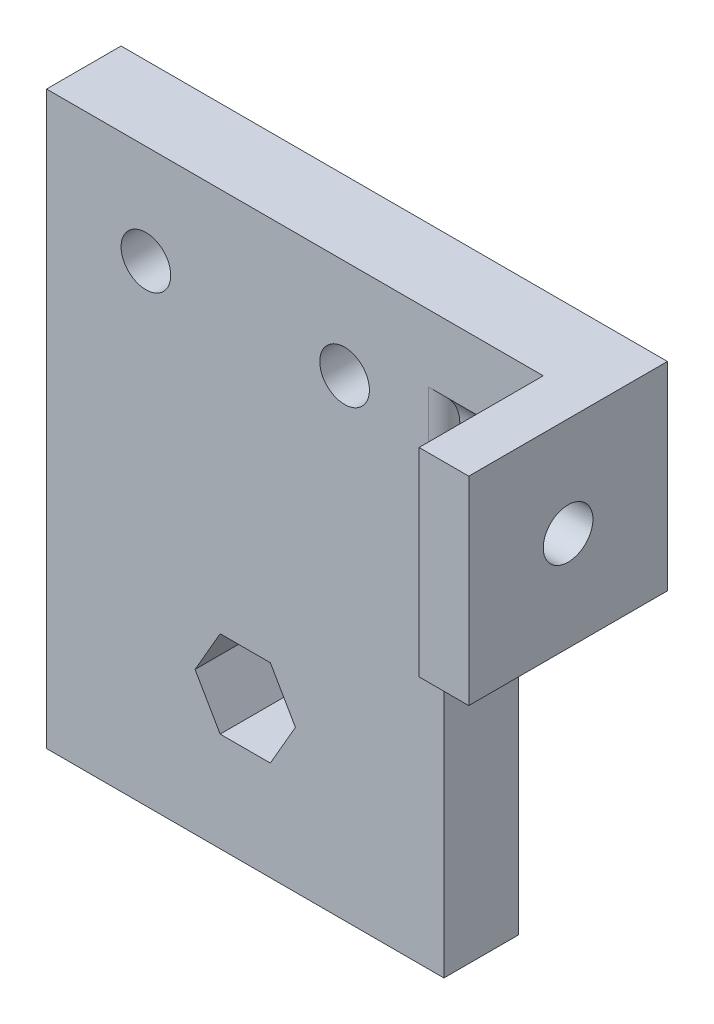
ISO-10303-21;
HEADER;
FILE_DESCRIPTION(('STEP AP214'),'2;1');
FILE_NAME('part.step','',(''),(''),'','','');
FILE_SCHEMA(('AUTOMOTIVE_DESIGN { 1 0 10303 214 1 1 1 1 }'));
ENDSEC;
DATA;
#1=APPLICATION_CONTEXT('core data for automotive mechanical design processes');
#2=APPLICATION_PROTOCOL_DEFINITION('international standard','automotive_design',2000,#1);
#3=PRODUCT_CONTEXT('',#1,'mechanical');
#4=PRODUCT('Part','Part','',(#3));
#5=PRODUCT_RELATED_PRODUCT_CATEGORY('part','',(#4));
#6=PRODUCT_DEFINITION_FORMATION('','',#4);
#7=PRODUCT_DEFINITION_CONTEXT('part definition',#1,'design');
#8=PRODUCT_DEFINITION('design','',#6,#7);
#9=PRODUCT_DEFINITION_SHAPE('','',#8);
#10=(LENGTH_UNIT() NAMED_UNIT(*) SI_UNIT(.MILLI.,.METRE.));
#11=(NAMED_UNIT(*) PLANE_ANGLE_UNIT() SI_UNIT($,.RADIAN.));
#12=(NAMED_UNIT(*) SI_UNIT($,.STERADIAN.) SOLID_ANGLE_UNIT());
#13=UNCERTAINTY_MEASURE_WITH_UNIT(LENGTH_MEASURE(1.E-05),#10,'distance_accuracy_value','');
#14=(GEOMETRIC_REPRESENTATION_CONTEXT(3) GLOBAL_UNCERTAINTY_ASSIGNED_CONTEXT((#13)) GLOBAL_UNIT_ASSIGNED_CONTEXT((#10,
#11,#12)) REPRESENTATION_CONTEXT('',''));
#15=CARTESIAN_POINT('',(0.,0.,0.));
#16=DIRECTION('',(0.,0.,1.));
#17=DIRECTION('',(1.,0.,0.));
#18=AXIS2_PLACEMENT_3D('',#15,#16,#17);
#19=CARTESIAN_POINT('',(0.,73.025,9.525));
#20=DIRECTION('',(0.,0.,-1.));
#21=DIRECTION('',(-1.,0.,0.));
#22=AXIS2_PLACEMENT_3D('',#19,#20,#21);
#23=PLANE('',#22);
#24=DIRECTION('',(0.499999999999999,0.866025403784439,0.));
#25=VECTOR('',#24,1.);
#26=CARTESIAN_POINT('',(28.6079024331849,12.7,9.525));
#27=LINE('',#26,#25);
#28=CARTESIAN_POINT('',(28.6079024331849,12.7,9.525));
#29=VERTEX_POINT('',#28);
#30=CARTESIAN_POINT('',(31.8158048663697,18.25625,9.525));
#31=VERTEX_POINT('',#30);
#32=EDGE_CURVE('E264',#29,#31,#27,.T.);
#33=ORIENTED_EDGE('',*,*,#32,.F.);
#34=DIRECTION('',(1.,0.,0.));
#35=VECTOR('',#34,1.);
#36=CARTESIAN_POINT('',(22.1920975668151,12.7,9.525));
#37=LINE('',#36,#35);
#38=CARTESIAN_POINT('',(22.1920975668151,12.7,9.525));
#39=VERTEX_POINT('',#38);
#40=EDGE_CURVE('E283',#39,#29,#37,.T.);
#41=ORIENTED_EDGE('',*,*,#40,.F.);
#42=DIRECTION('',(0.5,-0.866025403784439,0.));
#43=VECTOR('',#42,1.);
#44=CARTESIAN_POINT('',(18.9841951336303,18.25625,9.525));
#45=LINE('',#44,#43);
#46=CARTESIAN_POINT('',(18.9841951336303,18.25625,9.525));
#47=VERTEX_POINT('',#46);
#48=EDGE_CURVE('E562',#47,#39,#45,.T.);
#49=ORIENTED_EDGE('',*,*,#48,.F.);
#50=DIRECTION('',(-0.5,-0.866025403784439,0.));
#51=VECTOR('',#50,1.);
#52=CARTESIAN_POINT('',(22.1920975668151,23.8125,9.525));
#53=LINE('',#52,#51);
#54=CARTESIAN_POINT('',(22.1920975668151,23.8125,9.525));
#55=VERTEX_POINT('',#54);
#56=EDGE_CURVE('E559',#55,#47,#53,.T.);
#57=ORIENTED_EDGE('',*,*,#56,.F.);
#58=DIRECTION('',(-1.,0.,0.));
#59=VECTOR('',#58,1.);
#60=CARTESIAN_POINT('',(28.6079024331849,23.8125,9.525));
#61=LINE('',#60,#59);
#62=CARTESIAN_POINT('',(28.6079024331849,23.8125,9.525));
#63=VERTEX_POINT('',#62);
#64=EDGE_CURVE('E557',#63,#55,#61,.T.);
#65=ORIENTED_EDGE('',*,*,#64,.F.);
#66=DIRECTION('',(-0.5,0.866025403784439,0.));
#67=VECTOR('',#66,1.);
#68=CARTESIAN_POINT('',(31.8158048663697,18.25625,9.525));
#69=LINE('',#68,#67);
#70=EDGE_CURVE('E556',#31,#63,#69,.T.);
#71=ORIENTED_EDGE('',*,*,#70,.F.);
#72=EDGE_LOOP('',(#33,#41,#49,#57,#65,#71));
#73=FACE_BOUND('',#72,.T.);
#74=CARTESIAN_POINT('',(12.7,60.325,9.525));
#75=DIRECTION('',(0.,0.,1.));
#76=DIRECTION('',(1.,0.,0.));
#77=AXIS2_PLACEMENT_3D('',#74,#75,#76);
#78=CIRCLE('',#77,3.175);
#79=CARTESIAN_POINT('',(15.875,60.325,9.525));
#80=VERTEX_POINT('',#79);
#81=EDGE_CURVE('E221',#80,#80,#78,.T.);
#82=ORIENTED_EDGE('',*,*,#81,.F.);
#83=EDGE_LOOP('',(#82));
#84=FACE_BOUND('',#83,.T.);
#85=CARTESIAN_POINT('',(38.1,60.325,9.525));
#86=DIRECTION('',(0.,0.,1.));
#87=DIRECTION('',(-1.,0.,0.));
#88=AXIS2_PLACEMENT_3D('',#85,#86,#87);
#89=CIRCLE('',#88,3.175);
#90=CARTESIAN_POINT('',(34.925,60.325,9.525));
#91=VERTEX_POINT('',#90);
#92=EDGE_CURVE('E231',#91,#91,#89,.T.);
#93=ORIENTED_EDGE('',*,*,#92,.F.);
#94=EDGE_LOOP('',(#93));
#95=FACE_BOUND('',#94,.T.);
#96=DIRECTION('',(0.,1.,0.));
#97=VECTOR('',#96,1.);
#98=CARTESIAN_POINT('',(48.8,73.025,9.525));
#99=LINE('',#98,#97);
#100=CARTESIAN_POINT('',(48.8,56.1979884904449,9.525));
#101=VERTEX_POINT('',#100);
#102=CARTESIAN_POINT('',(48.8,64.452011509555,9.525));
#103=VERTEX_POINT('',#102);
#104=EDGE_CURVE('E168',#101,#103,#99,.T.);
#105=ORIENTED_EDGE('',*,*,#104,.T.);
#106=DIRECTION('',(1.,0.,0.));
#107=VECTOR('',#106,1.);
#108=CARTESIAN_POINT('',(50.8,64.452011509555,9.525));
#109=LINE('',#108,#107);
#110=CARTESIAN_POINT('',(63.5,64.452011509555,9.525));
#111=VERTEX_POINT('',#110);
#112=EDGE_CURVE('E156',#111,#103,#109,.F.);
#113=ORIENTED_EDGE('',*,*,#112,.F.);
#114=DIRECTION('',(0.,1.,0.));
#115=VECTOR('',#114,1.);
#116=CARTESIAN_POINT('',(63.5,73.025,9.525));
#117=LINE('',#116,#115);
#118=CARTESIAN_POINT('',(63.5,73.025,9.525));
#119=VERTEX_POINT('',#118);
#120=EDGE_CURVE('E165',#111,#119,#117,.T.);
#121=ORIENTED_EDGE('',*,*,#120,.T.);
#122=DIRECTION('',(-1.,0.,0.));
#123=VECTOR('',#122,1.);
#124=CARTESIAN_POINT('',(50.8,73.025,9.525));
#125=LINE('',#124,#123);
#126=CARTESIAN_POINT('',(0.,73.025,9.525));
#127=VERTEX_POINT('',#126);
#128=EDGE_CURVE('E178',#119,#127,#125,.T.);
#129=ORIENTED_EDGE('',*,*,#128,.T.);
#130=DIRECTION('',(0.,-1.,0.));
#131=VECTOR('',#130,1.);
#132=CARTESIAN_POINT('',(0.,0.,9.525));
#133=LINE('',#132,#131);
#134=CARTESIAN_POINT('',(0.,0.,9.525));
#135=VERTEX_POINT('',#134);
#136=EDGE_CURVE('E213',#127,#135,#133,.T.);
#137=ORIENTED_EDGE('',*,*,#136,.T.);
#138=DIRECTION('',(1.,0.,0.));
#139=VECTOR('',#138,1.);
#140=CARTESIAN_POINT('',(0.,0.,9.525));
#141=LINE('',#140,#139);
#142=CARTESIAN_POINT('',(50.8,0.,9.525));
#143=VERTEX_POINT('',#142);
#144=EDGE_CURVE('E238',#135,#143,#141,.T.);
#145=ORIENTED_EDGE('',*,*,#144,.T.);
#146=DIRECTION('',(0.,1.,0.));
#147=VECTOR('',#146,1.);
#148=CARTESIAN_POINT('',(50.8,0.,9.525));
#149=LINE('',#148,#147);
#150=CARTESIAN_POINT('',(50.8,47.625,9.525));
#151=VERTEX_POINT('',#150);
#152=EDGE_CURVE('E181',#143,#151,#149,.T.);
#153=ORIENTED_EDGE('',*,*,#152,.T.);
#154=DIRECTION('',(1.,0.,0.));
#155=VECTOR('',#154,1.);
#156=CARTESIAN_POINT('',(50.8,47.625,9.525));
#157=LINE('',#156,#155);
#158=CARTESIAN_POINT('',(63.5,47.625,9.525));
#159=VERTEX_POINT('',#158);
#160=EDGE_CURVE('E176',#151,#159,#157,.T.);
#161=ORIENTED_EDGE('',*,*,#160,.T.);
#162=CARTESIAN_POINT('',(63.5,56.1979884904449,9.525));
#163=VERTEX_POINT('',#162);
#164=EDGE_CURVE('E175',#159,#163,#117,.T.);
#165=ORIENTED_EDGE('',*,*,#164,.T.);
#166=DIRECTION('',(1.,0.,0.));
#167=VECTOR('',#166,1.);
#168=CARTESIAN_POINT('',(50.8,56.1979884904449,9.525));
#169=LINE('',#168,#167);
#170=EDGE_CURVE('E157',#101,#163,#169,.T.);
#171=ORIENTED_EDGE('',*,*,#170,.F.);
#172=EDGE_LOOP('',(#105,#113,#121,#129,#137,#145,#153,#161,#165,#171));
#173=FACE_BOUND('',#172,.T.);
#174=ADVANCED_FACE('F32',(#73,#84,#95,#173),#23,.F.);
#175=CARTESIAN_POINT('',(0.,73.025,0.));
#176=DIRECTION('',(0.,0.,-1.));
#177=DIRECTION('',(-1.,0.,0.));
#178=AXIS2_PLACEMENT_3D('',#175,#176,#177);
#179=PLANE('',#178);
#180=CARTESIAN_POINT('',(38.1,60.325,0.));
#181=DIRECTION('',(0.,0.,1.));
#182=DIRECTION('',(-1.,0.,0.));
#183=AXIS2_PLACEMENT_3D('',#180,#181,#182);
#184=CIRCLE('',#183,3.175);
#185=CARTESIAN_POINT('',(34.925,60.325,0.));
#186=VERTEX_POINT('',#185);
#187=EDGE_CURVE('E234',#186,#186,#184,.T.);
#188=ORIENTED_EDGE('',*,*,#187,.T.);
#189=EDGE_LOOP('',(#188));
#190=FACE_BOUND('',#189,.T.);
#191=DIRECTION('',(0.,-1.,0.));
#192=VECTOR('',#191,1.);
#193=CARTESIAN_POINT('',(0.,0.,0.));
#194=LINE('',#193,#192);
#195=CARTESIAN_POINT('',(0.,73.025,0.));
#196=VERTEX_POINT('',#195);
#197=CARTESIAN_POINT('',(0.,0.,0.));
#198=VERTEX_POINT('',#197);
#199=EDGE_CURVE('E192',#196,#198,#194,.T.);
#200=ORIENTED_EDGE('',*,*,#199,.F.);
#201=DIRECTION('',(-1.,0.,0.));
#202=VECTOR('',#201,1.);
#203=CARTESIAN_POINT('',(0.,73.025,0.));
#204=LINE('',#203,#202);
#205=CARTESIAN_POINT('',(69.85,73.025,0.));
#206=VERTEX_POINT('',#205);
#207=EDGE_CURVE('E211',#206,#196,#204,.T.);
#208=ORIENTED_EDGE('',*,*,#207,.F.);
#209=DIRECTION('',(0.,1.,0.));
#210=VECTOR('',#209,1.);
#211=CARTESIAN_POINT('',(69.85,73.025,0.));
#212=LINE('',#211,#210);
#213=CARTESIAN_POINT('',(69.85,47.625,0.));
#214=VERTEX_POINT('',#213);
#215=EDGE_CURVE('E536',#214,#206,#212,.T.);
#216=ORIENTED_EDGE('',*,*,#215,.F.);
#217=DIRECTION('',(1.,0.,0.));
#218=VECTOR('',#217,1.);
#219=CARTESIAN_POINT('',(50.8,47.625,0.));
#220=LINE('',#219,#218);
#221=CARTESIAN_POINT('',(50.8,47.625,0.));
#222=VERTEX_POINT('',#221);
#223=EDGE_CURVE('E214',#222,#214,#220,.T.);
#224=ORIENTED_EDGE('',*,*,#223,.F.);
#225=DIRECTION('',(0.,1.,0.));
#226=VECTOR('',#225,1.);
#227=CARTESIAN_POINT('',(50.8,0.,0.));
#228=LINE('',#227,#226);
#229=CARTESIAN_POINT('',(50.8,0.,0.));
#230=VERTEX_POINT('',#229);
#231=EDGE_CURVE('E216',#230,#222,#228,.T.);
#232=ORIENTED_EDGE('',*,*,#231,.F.);
#233=DIRECTION('',(1.,0.,0.));
#234=VECTOR('',#233,1.);
#235=CARTESIAN_POINT('',(0.,0.,0.));
#236=LINE('',#235,#234);
#237=EDGE_CURVE('E217',#198,#230,#236,.T.);
#238=ORIENTED_EDGE('',*,*,#237,.F.);
#239=EDGE_LOOP('',(#200,#208,#216,#224,#232,#238));
#240=FACE_BOUND('',#239,.T.);
#241=CARTESIAN_POINT('',(12.7,60.325,0.));
#242=DIRECTION('',(0.,0.,1.));
#243=DIRECTION('',(1.,0.,0.));
#244=AXIS2_PLACEMENT_3D('',#241,#242,#243);
#245=CIRCLE('',#244,3.175);
#246=CARTESIAN_POINT('',(15.875,60.325,0.));
#247=VERTEX_POINT('',#246);
#248=EDGE_CURVE('E226',#247,#247,#245,.T.);
#249=ORIENTED_EDGE('',*,*,#248,.T.);
#250=EDGE_LOOP('',(#249));
#251=FACE_BOUND('',#250,.T.);
#252=DIRECTION('',(1.,0.,0.));
#253=VECTOR('',#252,1.);
#254=CARTESIAN_POINT('',(22.1920975668151,12.7,0.));
#255=LINE('',#254,#253);
#256=CARTESIAN_POINT('',(22.1920975668151,12.7,0.));
#257=VERTEX_POINT('',#256);
#258=CARTESIAN_POINT('',(28.6079024331849,12.7,0.));
#259=VERTEX_POINT('',#258);
#260=EDGE_CURVE('E294',#257,#259,#255,.T.);
#261=ORIENTED_EDGE('',*,*,#260,.T.);
#262=DIRECTION('',(0.499999999999999,0.866025403784439,0.));
#263=VECTOR('',#262,1.);
#264=CARTESIAN_POINT('',(28.6079024331849,12.7,0.));
#265=LINE('',#264,#263);
#266=CARTESIAN_POINT('',(31.8158048663697,18.25625,0.));
#267=VERTEX_POINT('',#266);
#268=EDGE_CURVE('E273',#259,#267,#265,.T.);
#269=ORIENTED_EDGE('',*,*,#268,.T.);
#270=DIRECTION('',(-0.5,0.866025403784439,0.));
#271=VECTOR('',#270,1.);
#272=CARTESIAN_POINT('',(31.8158048663697,18.25625,0.));
#273=LINE('',#272,#271);
#274=CARTESIAN_POINT('',(28.6079024331849,23.8125,0.));
#275=VERTEX_POINT('',#274);
#276=EDGE_CURVE('E275',#267,#275,#273,.T.);
#277=ORIENTED_EDGE('',*,*,#276,.T.);
#278=DIRECTION('',(-1.,0.,0.));
#279=VECTOR('',#278,1.);
#280=CARTESIAN_POINT('',(28.6079024331849,23.8125,0.));
#281=LINE('',#280,#279);
#282=CARTESIAN_POINT('',(22.1920975668151,23.8125,0.));
#283=VERTEX_POINT('',#282);
#284=EDGE_CURVE('E280',#275,#283,#281,.T.);
#285=ORIENTED_EDGE('',*,*,#284,.T.);
#286=DIRECTION('',(-0.5,-0.866025403784439,0.));
#287=VECTOR('',#286,1.);
#288=CARTESIAN_POINT('',(22.1920975668151,23.8125,0.));
#289=LINE('',#288,#287);
#290=CARTESIAN_POINT('',(18.9841951336303,18.25625,0.));
#291=VERTEX_POINT('',#290);
#292=EDGE_CURVE('E288',#283,#291,#289,.T.);
#293=ORIENTED_EDGE('',*,*,#292,.T.);
#294=DIRECTION('',(0.5,-0.866025403784439,0.));
#295=VECTOR('',#294,1.);
#296=CARTESIAN_POINT('',(18.9841951336303,18.25625,0.));
#297=LINE('',#296,#295);
#298=EDGE_CURVE('E291',#291,#257,#297,.T.);
#299=ORIENTED_EDGE('',*,*,#298,.T.);
#300=EDGE_LOOP('',(#261,#269,#277,#285,#293,#299));
#301=FACE_BOUND('',#300,.T.);
#302=ADVANCED_FACE('F315',(#190,#240,#251,#301),#179,.T.);
#303=CARTESIAN_POINT('',(0.,0.,9.525));
#304=DIRECTION('',(1.,0.,0.));
#305=DIRECTION('',(0.,1.,0.));
#306=AXIS2_PLACEMENT_3D('',#303,#304,#305);
#307=PLANE('',#306);
#308=ORIENTED_EDGE('',*,*,#199,.T.);
#309=DIRECTION('',(0.,0.,-1.));
#310=VECTOR('',#309,1.);
#311=CARTESIAN_POINT('',(0.,0.,9.525));
#312=LINE('',#311,#310);
#313=EDGE_CURVE('E200',#135,#198,#312,.T.);
#314=ORIENTED_EDGE('',*,*,#313,.F.);
#315=ORIENTED_EDGE('',*,*,#136,.F.);
#316=DIRECTION('',(0.,0.,-1.));
#317=VECTOR('',#316,1.);
#318=CARTESIAN_POINT('',(0.,73.025,9.525));
#319=LINE('',#318,#317);
#320=EDGE_CURVE('E199',#127,#196,#319,.T.);
#321=ORIENTED_EDGE('',*,*,#320,.T.);
#322=EDGE_LOOP('',(#308,#314,#315,#321));
#323=FACE_BOUND('',#322,.T.);
#324=ADVANCED_FACE('F338',(#323),#307,.F.);
#325=CARTESIAN_POINT('',(0.,0.,9.525));
#326=DIRECTION('',(0.,1.,0.));
#327=DIRECTION('',(0.,0.,1.));
#328=AXIS2_PLACEMENT_3D('',#325,#326,#327);
#329=PLANE('',#328);
#330=ORIENTED_EDGE('',*,*,#237,.T.);
#331=DIRECTION('',(0.,0.,-1.));
#332=VECTOR('',#331,1.);
#333=CARTESIAN_POINT('',(50.8,0.,9.525));
#334=LINE('',#333,#332);
#335=EDGE_CURVE('E203',#143,#230,#334,.T.);
#336=ORIENTED_EDGE('',*,*,#335,.F.);
#337=ORIENTED_EDGE('',*,*,#144,.F.);
#338=ORIENTED_EDGE('',*,*,#313,.T.);
#339=EDGE_LOOP('',(#330,#336,#337,#338));
#340=FACE_BOUND('',#339,.T.);
#341=ADVANCED_FACE('F350',(#340),#329,.F.);
#342=CARTESIAN_POINT('',(50.8,0.,9.525));
#343=DIRECTION('',(-1.,0.,0.));
#344=DIRECTION('',(0.,0.,1.));
#345=AXIS2_PLACEMENT_3D('',#342,#343,#344);
#346=PLANE('',#345);
#347=ORIENTED_EDGE('',*,*,#231,.T.);
#348=DIRECTION('',(0.,0.,-1.));
#349=VECTOR('',#348,1.);
#350=CARTESIAN_POINT('',(50.8,47.625,9.525));
#351=LINE('',#350,#349);
#352=EDGE_CURVE('E206',#151,#222,#351,.T.);
#353=ORIENTED_EDGE('',*,*,#352,.F.);
#354=ORIENTED_EDGE('',*,*,#152,.F.);
#355=ORIENTED_EDGE('',*,*,#335,.T.);
#356=EDGE_LOOP('',(#347,#353,#354,#355));
#357=FACE_BOUND('',#356,.T.);
#358=ADVANCED_FACE('F243',(#357),#346,.F.);
#359=CARTESIAN_POINT('',(50.8,47.625,9.525));
#360=DIRECTION('',(0.,1.,0.));
#361=DIRECTION('',(0.,0.,1.));
#362=AXIS2_PLACEMENT_3D('',#359,#360,#361);
#363=PLANE('',#362);
#364=ORIENTED_EDGE('',*,*,#223,.T.);
#365=DIRECTION('',(0.,0.,-1.));
#366=VECTOR('',#365,1.);
#367=CARTESIAN_POINT('',(69.85,47.625,25.4));
#368=LINE('',#367,#366);
#369=CARTESIAN_POINT('',(69.85,47.625,25.4));
#370=VERTEX_POINT('',#369);
#371=EDGE_CURVE('E533',#370,#214,#368,.T.);
#372=ORIENTED_EDGE('',*,*,#371,.F.);
#373=DIRECTION('',(-1.,0.,0.));
#374=VECTOR('',#373,1.);
#375=CARTESIAN_POINT('',(69.85,47.625,25.4));
#376=LINE('',#375,#374);
#377=CARTESIAN_POINT('',(63.5,47.625,25.4));
#378=VERTEX_POINT('',#377);
#379=EDGE_CURVE('E252',#370,#378,#376,.T.);
#380=ORIENTED_EDGE('',*,*,#379,.T.);
#381=DIRECTION('',(0.,0.,-1.));
#382=VECTOR('',#381,1.);
#383=CARTESIAN_POINT('',(63.5,47.625,25.4));
#384=LINE('',#383,#382);
#385=EDGE_CURVE('E250',#378,#159,#384,.T.);
#386=ORIENTED_EDGE('',*,*,#385,.T.);
#387=ORIENTED_EDGE('',*,*,#160,.F.);
#388=ORIENTED_EDGE('',*,*,#352,.T.);
#389=EDGE_LOOP('',(#364,#372,#380,#386,#387,#388));
#390=FACE_BOUND('',#389,.T.);
#391=ADVANCED_FACE('F248',(#390),#363,.F.);
#392=CARTESIAN_POINT('',(0.,73.025,9.525));
#393=DIRECTION('',(0.,-1.,0.));
#394=DIRECTION('',(0.,0.,-1.));
#395=AXIS2_PLACEMENT_3D('',#392,#393,#394);
#396=PLANE('',#395);
#397=ORIENTED_EDGE('',*,*,#207,.T.);
#398=ORIENTED_EDGE('',*,*,#320,.F.);
#399=ORIENTED_EDGE('',*,*,#128,.F.);
#400=DIRECTION('',(0.,0.,1.));
#401=VECTOR('',#400,1.);
#402=CARTESIAN_POINT('',(63.5,73.025,25.4));
#403=LINE('',#402,#401);
#404=CARTESIAN_POINT('',(63.5,73.025,25.4));
#405=VERTEX_POINT('',#404);
#406=EDGE_CURVE('E173',#119,#405,#403,.T.);
#407=ORIENTED_EDGE('',*,*,#406,.T.);
#408=DIRECTION('',(-1.,0.,0.));
#409=VECTOR('',#408,1.);
#410=CARTESIAN_POINT('',(69.85,73.025,25.4));
#411=LINE('',#410,#409);
#412=CARTESIAN_POINT('',(69.85,73.025,25.4));
#413=VERTEX_POINT('',#412);
#414=EDGE_CURVE('E270',#413,#405,#411,.T.);
#415=ORIENTED_EDGE('',*,*,#414,.F.);
#416=DIRECTION('',(0.,0.,1.));
#417=VECTOR('',#416,1.);
#418=CARTESIAN_POINT('',(69.85,73.025,25.4));
#419=LINE('',#418,#417);
#420=EDGE_CURVE('E272',#206,#413,#419,.T.);
#421=ORIENTED_EDGE('',*,*,#420,.F.);
#422=EDGE_LOOP('',(#397,#398,#399,#407,#415,#421));
#423=FACE_BOUND('',#422,.T.);
#424=ADVANCED_FACE('F330',(#423),#396,.F.);
#425=CARTESIAN_POINT('',(12.7,60.325,9.525));
#426=DIRECTION('',(0.,0.,-1.));
#427=DIRECTION('',(-1.,0.,0.));
#428=AXIS2_PLACEMENT_3D('',#425,#426,#427);
#429=CYLINDRICAL_SURFACE('',#428,3.175);
#430=ORIENTED_EDGE('',*,*,#81,.T.);
#431=EDGE_LOOP('',(#430));
#432=FACE_BOUND('',#431,.T.);
#433=ORIENTED_EDGE('',*,*,#248,.F.);
#434=EDGE_LOOP('',(#433));
#435=FACE_BOUND('',#434,.T.);
#436=ADVANCED_FACE('F321',(#432,#435),#429,.F.);
#437=CARTESIAN_POINT('',(38.1,60.325,9.525));
#438=DIRECTION('',(0.,0.,-1.));
#439=DIRECTION('',(-1.,0.,0.));
#440=AXIS2_PLACEMENT_3D('',#437,#438,#439);
#441=CYLINDRICAL_SURFACE('',#440,3.175);
#442=ORIENTED_EDGE('',*,*,#92,.T.);
#443=EDGE_LOOP('',(#442));
#444=FACE_BOUND('',#443,.T.);
#445=ORIENTED_EDGE('',*,*,#187,.F.);
#446=EDGE_LOOP('',(#445));
#447=FACE_BOUND('',#446,.T.);
#448=ADVANCED_FACE('F318',(#444,#447),#441,.F.);
#449=CARTESIAN_POINT('',(28.6079024331849,12.7,9.525));
#450=DIRECTION('',(-0.866025403784439,0.499999999999999,0.));
#451=DIRECTION('',(-0.499999999999999,-0.866025403784439,0.));
#452=AXIS2_PLACEMENT_3D('',#449,#450,#451);
#453=PLANE('',#452);
#454=ORIENTED_EDGE('',*,*,#268,.F.);
#455=DIRECTION('',(0.,0.,-1.));
#456=VECTOR('',#455,1.);
#457=CARTESIAN_POINT('',(28.6079024331849,12.7,9.525));
#458=LINE('',#457,#456);
#459=EDGE_CURVE('E296',#29,#259,#458,.T.);
#460=ORIENTED_EDGE('',*,*,#459,.F.);
#461=ORIENTED_EDGE('',*,*,#32,.T.);
#462=DIRECTION('',(0.,0.,-1.));
#463=VECTOR('',#462,1.);
#464=CARTESIAN_POINT('',(31.8158048663697,18.25625,9.525));
#465=LINE('',#464,#463);
#466=EDGE_CURVE('E307',#31,#267,#465,.T.);
#467=ORIENTED_EDGE('',*,*,#466,.T.);
#468=EDGE_LOOP('',(#454,#460,#461,#467));
#469=FACE_BOUND('',#468,.T.);
#470=ADVANCED_FACE('F320',(#469),#453,.T.);
#471=CARTESIAN_POINT('',(31.8158048663697,18.25625,9.525));
#472=DIRECTION('',(-0.866025403784439,-0.5,0.));
#473=DIRECTION('',(0.5,-0.866025403784438,0.));
#474=AXIS2_PLACEMENT_3D('',#471,#472,#473);
#475=PLANE('',#474);
#476=ORIENTED_EDGE('',*,*,#276,.F.);
#477=ORIENTED_EDGE('',*,*,#466,.F.);
#478=ORIENTED_EDGE('',*,*,#70,.T.);
#479=DIRECTION('',(0.,0.,-1.));
#480=VECTOR('',#479,1.);
#481=CARTESIAN_POINT('',(28.6079024331849,23.8125,9.525));
#482=LINE('',#481,#480);
#483=EDGE_CURVE('E305',#63,#275,#482,.T.);
#484=ORIENTED_EDGE('',*,*,#483,.T.);
#485=EDGE_LOOP('',(#476,#477,#478,#484));
#486=FACE_BOUND('',#485,.T.);
#487=ADVANCED_FACE('F327',(#486),#475,.T.);
#488=CARTESIAN_POINT('',(28.6079024331849,23.8125,9.525));
#489=DIRECTION('',(0.,-1.,0.));
#490=DIRECTION('',(0.,0.,-1.));
#491=AXIS2_PLACEMENT_3D('',#488,#489,#490);
#492=PLANE('',#491);
#493=ORIENTED_EDGE('',*,*,#284,.F.);
#494=ORIENTED_EDGE('',*,*,#483,.F.);
#495=ORIENTED_EDGE('',*,*,#64,.T.);
#496=DIRECTION('',(0.,0.,-1.));
#497=VECTOR('',#496,1.);
#498=CARTESIAN_POINT('',(22.1920975668151,23.8125,9.525));
#499=LINE('',#498,#497);
#500=EDGE_CURVE('E303',#55,#283,#499,.T.);
#501=ORIENTED_EDGE('',*,*,#500,.T.);
#502=EDGE_LOOP('',(#493,#494,#495,#501));
#503=FACE_BOUND('',#502,.T.);
#504=ADVANCED_FACE('F398',(#503),#492,.T.);
#505=CARTESIAN_POINT('',(22.1920975668151,23.8125,9.525));
#506=DIRECTION('',(0.866025403784439,-0.5,0.));
#507=DIRECTION('',(0.5,0.866025403784439,0.));
#508=AXIS2_PLACEMENT_3D('',#505,#506,#507);
#509=PLANE('',#508);
#510=ORIENTED_EDGE('',*,*,#292,.F.);
#511=ORIENTED_EDGE('',*,*,#500,.F.);
#512=ORIENTED_EDGE('',*,*,#56,.T.);
#513=DIRECTION('',(0.,0.,-1.));
#514=VECTOR('',#513,1.);
#515=CARTESIAN_POINT('',(18.9841951336303,18.25625,9.525));
#516=LINE('',#515,#514);
#517=EDGE_CURVE('E301',#47,#291,#516,.T.);
#518=ORIENTED_EDGE('',*,*,#517,.T.);
#519=EDGE_LOOP('',(#510,#511,#512,#518));
#520=FACE_BOUND('',#519,.T.);
#521=ADVANCED_FACE('F408',(#520),#509,.T.);
#522=CARTESIAN_POINT('',(18.9841951336303,18.25625,9.525));
#523=DIRECTION('',(0.866025403784439,0.5,0.));
#524=DIRECTION('',(-0.5,0.866025403784439,0.));
#525=AXIS2_PLACEMENT_3D('',#522,#523,#524);
#526=PLANE('',#525);
#527=ORIENTED_EDGE('',*,*,#298,.F.);
#528=ORIENTED_EDGE('',*,*,#517,.F.);
#529=ORIENTED_EDGE('',*,*,#48,.T.);
#530=DIRECTION('',(0.,0.,-1.));
#531=VECTOR('',#530,1.);
#532=CARTESIAN_POINT('',(22.1920975668151,12.7,9.525));
#533=LINE('',#532,#531);
#534=EDGE_CURVE('E299',#39,#257,#533,.T.);
#535=ORIENTED_EDGE('',*,*,#534,.T.);
#536=EDGE_LOOP('',(#527,#528,#529,#535));
#537=FACE_BOUND('',#536,.T.);
#538=ADVANCED_FACE('F418',(#537),#526,.T.);
#539=CARTESIAN_POINT('',(22.1920975668151,12.7,9.525));
#540=DIRECTION('',(0.,1.,0.));
#541=DIRECTION('',(-1.,0.,0.));
#542=AXIS2_PLACEMENT_3D('',#539,#540,#541);
#543=PLANE('',#542);
#544=ORIENTED_EDGE('',*,*,#260,.F.);
#545=ORIENTED_EDGE('',*,*,#534,.F.);
#546=ORIENTED_EDGE('',*,*,#40,.T.);
#547=ORIENTED_EDGE('',*,*,#459,.T.);
#548=EDGE_LOOP('',(#544,#545,#546,#547));
#549=FACE_BOUND('',#548,.T.);
#550=ADVANCED_FACE('F428',(#549),#543,.T.);
#551=CARTESIAN_POINT('',(69.85,47.625,25.4));
#552=DIRECTION('',(1.,0.,0.));
#553=DIRECTION('',(0.,1.,0.));
#554=AXIS2_PLACEMENT_3D('',#551,#552,#553);
#555=PLANE('',#554);
#556=DIRECTION('',(0.,-1.,0.));
#557=VECTOR('',#556,1.);
#558=CARTESIAN_POINT('',(69.85,73.025,25.4));
#559=LINE('',#558,#557);
#560=EDGE_CURVE('E256',#413,#370,#559,.T.);
#561=ORIENTED_EDGE('',*,*,#560,.T.);
#562=ORIENTED_EDGE('',*,*,#371,.T.);
#563=ORIENTED_EDGE('',*,*,#215,.T.);
#564=ORIENTED_EDGE('',*,*,#420,.T.);
#565=EDGE_LOOP('',(#561,#562,#563,#564));
#566=FACE_BOUND('',#565,.T.);
#567=CARTESIAN_POINT('',(69.85,60.325,12.7));
#568=DIRECTION('',(1.,0.,0.));
#569=DIRECTION('',(0.,1.,0.));
#570=AXIS2_PLACEMENT_3D('',#567,#568,#569);
#571=CIRCLE('',#570,3.175);
#572=CARTESIAN_POINT('',(69.85,63.5,12.7));
#573=VERTEX_POINT('',#572);
#574=EDGE_CURVE('E258',#573,#573,#571,.T.);
#575=ORIENTED_EDGE('',*,*,#574,.F.);
#576=EDGE_LOOP('',(#575));
#577=FACE_BOUND('',#576,.T.);
#578=ADVANCED_FACE('F437',(#566,#577),#555,.T.);
#579=CARTESIAN_POINT('',(63.5,47.625,25.4));
#580=DIRECTION('',(1.,0.,0.));
#581=DIRECTION('',(0.,1.,0.));
#582=AXIS2_PLACEMENT_3D('',#579,#580,#581);
#583=PLANE('',#582);
#584=CARTESIAN_POINT('',(63.5,60.325,12.7));
#585=DIRECTION('',(1.,0.,0.));
#586=DIRECTION('',(0.,1.,0.));
#587=AXIS2_PLACEMENT_3D('',#584,#585,#586);
#588=CIRCLE('',#587,3.175);
#589=CARTESIAN_POINT('',(63.5,63.5,12.7));
#590=VERTEX_POINT('',#589);
#591=EDGE_CURVE('E169',#590,#590,#588,.T.);
#592=ORIENTED_EDGE('',*,*,#591,.T.);
#593=EDGE_LOOP('',(#592));
#594=FACE_BOUND('',#593,.T.);
#595=CARTESIAN_POINT('',(63.5,60.325,12.7));
#596=DIRECTION('',(-1.,0.,0.));
#597=DIRECTION('',(0.,-1.,0.));
#598=AXIS2_PLACEMENT_3D('',#595,#596,#597);
#599=CIRCLE('',#598,5.207);
#600=EDGE_CURVE('E153',#111,#163,#599,.T.);
#601=ORIENTED_EDGE('',*,*,#600,.T.);
#602=ORIENTED_EDGE('',*,*,#164,.F.);
#603=ORIENTED_EDGE('',*,*,#385,.F.);
#604=DIRECTION('',(0.,-1.,0.));
#605=VECTOR('',#604,1.);
#606=CARTESIAN_POINT('',(63.5,73.025,25.4));
#607=LINE('',#606,#605);
#608=EDGE_CURVE('E254',#405,#378,#607,.T.);
#609=ORIENTED_EDGE('',*,*,#608,.F.);
#610=ORIENTED_EDGE('',*,*,#406,.F.);
#611=ORIENTED_EDGE('',*,*,#120,.F.);
#612=EDGE_LOOP('',(#601,#602,#603,#609,#610,#611));
#613=FACE_BOUND('',#612,.T.);
#614=ADVANCED_FACE('F171',(#594,#613),#583,.F.);
#615=CARTESIAN_POINT('',(69.85,73.025,25.4));
#616=DIRECTION('',(0.,0.,-1.));
#617=DIRECTION('',(0.,1.,0.));
#618=AXIS2_PLACEMENT_3D('',#615,#616,#617);
#619=PLANE('',#618);
#620=ORIENTED_EDGE('',*,*,#608,.T.);
#621=ORIENTED_EDGE('',*,*,#379,.F.);
#622=ORIENTED_EDGE('',*,*,#560,.F.);
#623=ORIENTED_EDGE('',*,*,#414,.T.);
#624=EDGE_LOOP('',(#620,#621,#622,#623));
#625=FACE_BOUND('',#624,.T.);
#626=ADVANCED_FACE('F474',(#625),#619,.F.);
#627=CARTESIAN_POINT('',(69.85,60.325,12.7));
#628=DIRECTION('',(-1.,0.,0.));
#629=DIRECTION('',(0.,-1.,0.));
#630=AXIS2_PLACEMENT_3D('',#627,#628,#629);
#631=CYLINDRICAL_SURFACE('',#630,3.175);
#632=ORIENTED_EDGE('',*,*,#574,.T.);
#633=EDGE_LOOP('',(#632));
#634=FACE_BOUND('',#633,.T.);
#635=ORIENTED_EDGE('',*,*,#591,.F.);
#636=EDGE_LOOP('',(#635));
#637=FACE_BOUND('',#636,.T.);
#638=ADVANCED_FACE('F486',(#634,#637),#631,.F.);
#639=CARTESIAN_POINT('',(50.8,60.325,12.7));
#640=DIRECTION('',(-1.,0.,0.));
#641=DIRECTION('',(0.,-1.,0.));
#642=AXIS2_PLACEMENT_3D('',#639,#640,#641);
#643=PLANE('',#642);
#644=CARTESIAN_POINT('',(50.8,60.325,12.7));
#645=DIRECTION('',(-1.,0.,0.));
#646=DIRECTION('',(0.,-1.,0.));
#647=AXIS2_PLACEMENT_3D('',#644,#645,#646);
#648=CIRCLE('',#647,5.207);
#649=CARTESIAN_POINT('',(50.8,60.9013887576974,7.525));
#650=VERTEX_POINT('',#649);
#651=CARTESIAN_POINT('',(50.8,59.7486112423025,7.525));
#652=VERTEX_POINT('',#651);
#653=EDGE_CURVE('E161',#650,#652,#648,.T.);
#654=ORIENTED_EDGE('',*,*,#653,.F.);
#655=DIRECTION('',(0.,1.,0.));
#656=VECTOR('',#655,1.);
#657=CARTESIAN_POINT('',(50.8,60.325,7.525));
#658=LINE('',#657,#656);
#659=EDGE_CURVE('E51',#650,#652,#658,.F.);
#660=ORIENTED_EDGE('',*,*,#659,.T.);
#661=EDGE_LOOP('',(#654,#660));
#662=FACE_BOUND('',#661,.T.);
#663=ADVANCED_FACE('F494',(#662),#643,.F.);
#664=CARTESIAN_POINT('',(50.8,60.325,12.7));
#665=DIRECTION('',(1.,0.,0.));
#666=DIRECTION('',(0.,1.,0.));
#667=AXIS2_PLACEMENT_3D('',#664,#665,#666);
#668=CYLINDRICAL_SURFACE('',#667,5.207);
#669=ORIENTED_EDGE('',*,*,#112,.T.);
#670=CARTESIAN_POINT('',(48.8,64.452011509555,9.525));
#671=CARTESIAN_POINT('',(48.8462198371007,64.4520120414311,9.52500872535172));
#672=CARTESIAN_POINT('',(48.8924362531844,64.4507788965428,9.52339799745254));
#673=CARTESIAN_POINT('',(48.9845071472261,64.4458507239219,9.51700328024167));
#674=CARTESIAN_POINT('',(49.0303617018728,64.4421562328124,9.51221998261501));
#675=CARTESIAN_POINT('',(49.1212141428741,64.4323281513223,9.49956801084569));
#676=CARTESIAN_POINT('',(49.1662144753703,64.4262031869253,9.49171024963492));
#677=CARTESIAN_POINT('',(49.2551844908465,64.4115323307189,9.47304437082469));
#678=CARTESIAN_POINT('',(49.2991541586464,64.4029864032771,9.46223620980039));
#679=CARTESIAN_POINT('',(49.4290296457978,64.3737425184668,9.42562682209159));
#680=CARTESIAN_POINT('',(49.5130056890654,64.3494273385207,9.39562577776739));
#681=CARTESIAN_POINT('',(49.6734992441098,64.2914833564983,9.32629498838111));
#682=CARTESIAN_POINT('',(49.7500140488571,64.2578511909773,9.28696187516663));
#683=CARTESIAN_POINT('',(49.8962678557608,64.1806891295498,9.20000423761126));
#684=CARTESIAN_POINT('',(49.9657465277311,64.1369008507239,9.15217261878031));
#685=CARTESIAN_POINT('',(50.0945690353704,64.0408476890684,9.05168967134465));
#686=CARTESIAN_POINT('',(50.1539080040466,63.988578758915,8.99903604672777));
#687=CARTESIAN_POINT('',(50.2852012138728,63.8530592377209,8.86884946782571));
#688=CARTESIAN_POINT('',(50.352044950583,63.7659963671926,8.79012495652959));
#689=CARTESIAN_POINT('',(50.4674108424493,63.5796909204821,8.63371256277282));
#690=CARTESIAN_POINT('',(50.515901976552,63.4804280947046,8.55602664769902));
#691=CARTESIAN_POINT('',(50.5863565789722,63.3013894328443,8.42652470265492));
#692=CARTESIAN_POINT('',(50.6119474055865,63.2238449761996,8.37350973724859));
#693=CARTESIAN_POINT('',(50.6565174198239,63.0646177580931,8.27097006186163));
#694=CARTESIAN_POINT('',(50.6754935367575,62.9829330947588,8.22144698137554));
#695=CARTESIAN_POINT('',(50.708105276349,62.8158274887211,8.12638970508707));
#696=CARTESIAN_POINT('',(50.7217192457758,62.7303929147951,8.08087224732146));
#697=CARTESIAN_POINT('',(50.7446327968852,62.5566438293782,7.99446763898421));
#698=CARTESIAN_POINT('',(50.7539312383954,62.4683285633905,7.95358171422867));
#699=CARTESIAN_POINT('',(50.7716309380131,62.2610437105638,7.86460949566849));
#700=CARTESIAN_POINT('',(50.7788229014609,62.1411960711703,7.81832310666777));
#701=CARTESIAN_POINT('',(50.7894235733432,61.8982287638975,7.73468774429786));
#702=CARTESIAN_POINT('',(50.7928305459233,61.7751076212214,7.69734287780078));
#703=CARTESIAN_POINT('',(50.7973883491216,61.5277431323564,7.63221617207241));
#704=CARTESIAN_POINT('',(50.7985632732905,61.4035264831376,7.60433490820728));
#705=CARTESIAN_POINT('',(50.7995401354028,61.2159964830041,7.5694038414815));
#706=CARTESIAN_POINT('',(50.7997349030348,61.153307318836,7.55891103903631));
#707=CARTESIAN_POINT('',(50.799963268841,61.0275865851352,7.54022686816862));
#708=CARTESIAN_POINT('',(50.7999968669265,60.9645550154144,7.53203550101118));
#709=CARTESIAN_POINT('',(50.8,60.9013887576974,7.525));
#710=B_SPLINE_CURVE_WITH_KNOTS('',3,(#670,#671,#672,#673,#674,#675,#676,#677,#678,#679,#680,
#681,#682,#683,#684,#685,#686,#687,#688,#689,#690,#691,#692,#693,#694,#695,#696,#697,#698,#699,
#700,#701,#702,#703,#704,#705,#706,#707,#708,#709),.UNSPECIFIED.,.F.,.F.,(4,2,2,2,2,2,2,2,2,2,2,
2,2,2,2,2,2,2,2,4),(0.,0.138609184602268,0.277188159499121,0.415279641212909,0.553373155506754,
0.829248100143055,1.10522276609301,1.38918796870013,1.67328909223872,2.07626533582924,
2.47991971233742,2.77161488056124,3.06344528013864,3.3564423443551,3.64951677506931,
4.03508495733091,4.42082989412015,4.80238676056271,4.99303466583294,5.18368267589987),.UNSPECIFIED.);
#711=EDGE_CURVE('E45',#103,#650,#710,.T.);
#712=ORIENTED_EDGE('',*,*,#711,.T.);
#713=ORIENTED_EDGE('',*,*,#653,.T.);
#714=CARTESIAN_POINT('',(50.8,59.7486112423025,7.525));
#715=CARTESIAN_POINT('',(50.7999949066616,59.6772914452378,7.53294373911507));
#716=CARTESIAN_POINT('',(50.7999533063097,59.6061444784486,7.54236079623887));
#717=CARTESIAN_POINT('',(50.7996478149417,59.464297809929,7.56412700258147));
#718=CARTESIAN_POINT('',(50.7993839140503,59.3935981282091,7.5764762820415));
#719=CARTESIAN_POINT('',(50.7980335343093,59.1821303774934,7.61793889664954));
#720=CARTESIAN_POINT('',(50.7963875369251,59.0421983263415,7.65144419887707));
#721=CARTESIAN_POINT('',(50.7898300620135,58.7641406890351,7.73032287708751));
#722=CARTESIAN_POINT('',(50.7848828112227,58.6260519846953,7.77582292747989));
#723=CARTESIAN_POINT('',(50.7692690966823,58.3545163334436,7.87806670947428));
#724=CARTESIAN_POINT('',(50.7586082264586,58.2210649824801,7.93479941032848));
#725=CARTESIAN_POINT('',(50.7346452645891,58.0133079405732,8.03349487056719));
#726=CARTESIAN_POINT('',(50.724186463701,57.9370463310358,8.07206475540728));
#727=CARTESIAN_POINT('',(50.6994353768734,57.7869782201449,8.1526335123449));
#728=CARTESIAN_POINT('',(50.6851431262125,57.7131716962046,8.19463235288385));
#729=CARTESIAN_POINT('',(50.6519779798158,57.5687341033451,8.28152538039873));
#730=CARTESIAN_POINT('',(50.6331233500617,57.4980916708806,8.32640751022979));
#731=CARTESIAN_POINT('',(50.5899569041538,57.3602141547763,8.41867050363337));
#732=CARTESIAN_POINT('',(50.5656466123193,57.2929781258022,8.46605066642853));
#733=CARTESIAN_POINT('',(50.4965500563093,57.1289378222036,8.58744948897757));
#734=CARTESIAN_POINT('',(50.4476581536432,57.0346667087575,8.66266067520359));
#735=CARTESIAN_POINT('',(50.3325053063295,56.8577329828989,8.81356281824199));
#736=CARTESIAN_POINT('',(50.2662614333808,56.7750590826774,8.8892532325357));
#737=CARTESIAN_POINT('',(50.1294907500129,56.6386632586233,9.02154922623779));
#738=CARTESIAN_POINT('',(50.0623002052343,56.5824374527188,9.07900437928366));
#739=CARTESIAN_POINT('',(49.9156752573646,56.480523904463,9.18739620418604));
#740=CARTESIAN_POINT('',(49.8362446825203,56.4348328783221,9.23833490507179));
#741=CARTESIAN_POINT('',(49.6658886261223,56.3547613837997,9.33045597062801));
#742=CARTESIAN_POINT('',(49.5748923877119,56.320455677573,9.37157336808764));
#743=CARTESIAN_POINT('',(49.3843932185633,56.2642405889699,9.44038658682826));
#744=CARTESIAN_POINT('',(49.2848992102845,56.2423183840111,9.46809628692124));
#745=CARTESIAN_POINT('',(49.1203937777861,56.2171539546128,9.50020486459212));
#746=CARTESIAN_POINT('',(49.0568750912045,56.2099684643858,9.50947211622581));
#747=CARTESIAN_POINT('',(48.9289190958797,56.2003885080784,9.52187976808562));
#748=CARTESIAN_POINT('',(48.8644822671381,56.1979916248575,9.52502325937634));
#749=CARTESIAN_POINT('',(48.8,56.1979884904449,9.525));
#750=B_SPLINE_CURVE_WITH_KNOTS('',3,(#714,#715,#716,#717,#718,#719,#720,#721,#722,#723,#724,
#725,#726,#727,#728,#729,#730,#731,#732,#733,#734,#735,#736,#737,#738,#739,#740,#741,#742,#743,
#744,#745,#746,#747,#748,#749),.UNSPECIFIED.,.F.,.F.,(4,2,2,2,2,2,2,2,2,2,2,2,2,2,2,2,2,4),(0.,
0.215249635568918,0.430508833721156,0.861643286972841,1.29752718139302,1.73298513108562,
1.9911212623388,2.24925501809001,2.50637192633143,2.76341708500023,3.15237356222723,
3.54094879346886,3.85398219858752,4.16691789594753,4.4818696143064,4.79649461310381,
4.98983208950826,5.18307195046025),.UNSPECIFIED.);
#751=EDGE_CURVE('E11',#652,#101,#750,.T.);
#752=ORIENTED_EDGE('',*,*,#751,.T.);
#753=ORIENTED_EDGE('',*,*,#170,.T.);
#754=ORIENTED_EDGE('',*,*,#600,.F.);
#755=EDGE_LOOP('',(#669,#712,#713,#752,#753,#754));
#756=FACE_BOUND('',#755,.T.);
#757=ADVANCED_FACE('F155',(#756),#668,.F.);
#758=CARTESIAN_POINT('',(48.8,73.025,7.525));
#759=DIRECTION('',(0.,1.,0.));
#760=DIRECTION('',(-1.,0.,0.));
#761=AXIS2_PLACEMENT_3D('',#758,#759,#760);
#762=CYLINDRICAL_SURFACE('',#761,2.);
#763=ORIENTED_EDGE('',*,*,#751,.F.);
#764=ORIENTED_EDGE('',*,*,#659,.F.);
#765=ORIENTED_EDGE('',*,*,#711,.F.);
#766=ORIENTED_EDGE('',*,*,#104,.F.);
#767=EDGE_LOOP('',(#763,#764,#765,#766));
#768=FACE_BOUND('',#767,.T.);
#769=ADVANCED_FACE('F34',(#768),#762,.T.);
#770=CLOSED_SHELL('',(#174,#302,#324,#341,#358,#391,#424,#436,#448,#470,#487,#504,#521,#538,
#550,#578,#614,#626,#638,#663,#757,#769));
#771=MANIFOLD_SOLID_BREP('B2',#770);
#772=ADVANCED_BREP_SHAPE_REPRESENTATION('',(#18,#771),#14);
#773=SHAPE_DEFINITION_REPRESENTATION(#9,#772);
ENDSEC;
END-ISO-10303-21;
